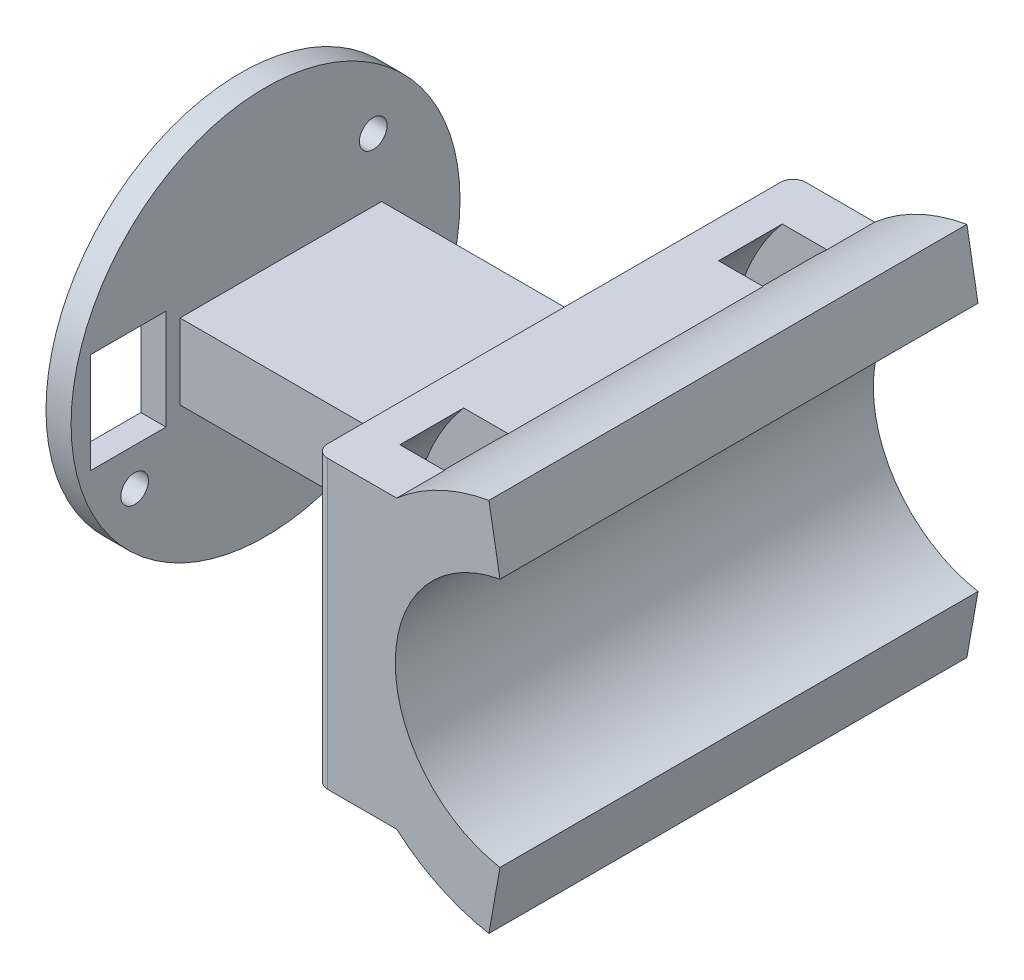
ISO-10303-21;
HEADER;
FILE_DESCRIPTION(('STEP AP214'),'2;1');
FILE_NAME('part.step','',(''),(''),'','','');
FILE_SCHEMA(('AUTOMOTIVE_DESIGN { 1 0 10303 214 1 1 1 1 }'));
ENDSEC;
DATA;
#1=APPLICATION_CONTEXT('core data for automotive mechanical design processes');
#2=APPLICATION_PROTOCOL_DEFINITION('international standard','automotive_design',2000,#1);
#3=PRODUCT_CONTEXT('',#1,'mechanical');
#4=PRODUCT('Part','Part','',(#3));
#5=PRODUCT_RELATED_PRODUCT_CATEGORY('part','',(#4));
#6=PRODUCT_DEFINITION_FORMATION('','',#4);
#7=PRODUCT_DEFINITION_CONTEXT('part definition',#1,'design');
#8=PRODUCT_DEFINITION('design','',#6,#7);
#9=PRODUCT_DEFINITION_SHAPE('','',#8);
#10=(LENGTH_UNIT() NAMED_UNIT(*) SI_UNIT(.MILLI.,.METRE.));
#11=(NAMED_UNIT(*) PLANE_ANGLE_UNIT() SI_UNIT($,.RADIAN.));
#12=(NAMED_UNIT(*) SI_UNIT($,.STERADIAN.) SOLID_ANGLE_UNIT());
#13=UNCERTAINTY_MEASURE_WITH_UNIT(LENGTH_MEASURE(1.E-05),#10,'distance_accuracy_value','');
#14=(GEOMETRIC_REPRESENTATION_CONTEXT(3) GLOBAL_UNCERTAINTY_ASSIGNED_CONTEXT((#13)) GLOBAL_UNIT_ASSIGNED_CONTEXT((#10,
#11,#12)) REPRESENTATION_CONTEXT('',''));
#15=CARTESIAN_POINT('',(0.,0.,0.));
#16=DIRECTION('',(0.,0.,1.));
#17=DIRECTION('',(1.,0.,0.));
#18=AXIS2_PLACEMENT_3D('',#15,#16,#17);
#19=CARTESIAN_POINT('',(-6.38936934946346,-11.43,19.05));
#20=DIRECTION('',(1.,0.,0.));
#21=DIRECTION('',(0.,1.,0.));
#22=AXIS2_PLACEMENT_3D('',#19,#20,#21);
#23=PLANE('',#22);
#24=DIRECTION('',(0.,0.,1.));
#25=VECTOR('',#24,1.);
#26=CARTESIAN_POINT('',(-6.38936934946345,-6.48838180573363,19.05));
#27=LINE('',#26,#25);
#28=CARTESIAN_POINT('',(-6.38936934946345,-6.48838180573363,-15.24));
#29=VERTEX_POINT('',#28);
#30=CARTESIAN_POINT('',(-6.38936934946346,-6.48838180573361,-10.16));
#31=VERTEX_POINT('',#30);
#32=EDGE_CURVE('E364',#29,#31,#27,.T.);
#33=ORIENTED_EDGE('',*,*,#32,.F.);
#34=DIRECTION('',(0.,1.,0.));
#35=VECTOR('',#34,1.);
#36=CARTESIAN_POINT('',(-6.38936934946346,-11.43,-15.24));
#37=LINE('',#36,#35);
#38=CARTESIAN_POINT('',(-6.38936934946345,6.48838180573364,-15.24));
#39=VERTEX_POINT('',#38);
#40=EDGE_CURVE('E349',#29,#39,#37,.T.);
#41=ORIENTED_EDGE('',*,*,#40,.T.);
#42=DIRECTION('',(0.,0.,1.));
#43=VECTOR('',#42,1.);
#44=CARTESIAN_POINT('',(-6.38936934946345,6.48838180573364,19.05));
#45=LINE('',#44,#43);
#46=CARTESIAN_POINT('',(-6.38936934946346,6.48838180573362,-10.16));
#47=VERTEX_POINT('',#46);
#48=EDGE_CURVE('E367',#47,#39,#45,.F.);
#49=ORIENTED_EDGE('',*,*,#48,.F.);
#50=DIRECTION('',(0.,1.,0.));
#51=VECTOR('',#50,1.);
#52=CARTESIAN_POINT('',(-6.38936934946346,-11.43,-10.16));
#53=LINE('',#52,#51);
#54=EDGE_CURVE('E341',#31,#47,#53,.T.);
#55=ORIENTED_EDGE('',*,*,#54,.F.);
#56=EDGE_LOOP('',(#33,#41,#49,#55));
#57=FACE_BOUND('',#56,.T.);
#58=DIRECTION('',(0.,-1.,0.));
#59=VECTOR('',#58,1.);
#60=CARTESIAN_POINT('',(-6.38936934946346,-3.,-9.2493893907033));
#61=LINE('',#60,#59);
#62=CARTESIAN_POINT('',(-6.38936934946346,3.,-9.2493893907033));
#63=VERTEX_POINT('',#62);
#64=CARTESIAN_POINT('',(-6.38936934946346,-3.,-9.2493893907033));
#65=VERTEX_POINT('',#64);
#66=EDGE_CURVE('E369',#63,#65,#61,.T.);
#67=ORIENTED_EDGE('',*,*,#66,.F.);
#68=DIRECTION('',(0.,0.,-1.));
#69=VECTOR('',#68,1.);
#70=CARTESIAN_POINT('',(-6.38936934946346,3.,-9.2493893907033));
#71=LINE('',#70,#69);
#72=CARTESIAN_POINT('',(-6.38936934946346,3.,6.82201027291285));
#73=VERTEX_POINT('',#72);
#74=EDGE_CURVE('E374',#73,#63,#71,.T.);
#75=ORIENTED_EDGE('',*,*,#74,.F.);
#76=DIRECTION('',(0.,1.,0.));
#77=VECTOR('',#76,1.);
#78=CARTESIAN_POINT('',(-6.38936934946346,-3.,6.82201027291285));
#79=LINE('',#78,#77);
#80=CARTESIAN_POINT('',(-6.38936934946346,-3.,6.82201027291285));
#81=VERTEX_POINT('',#80);
#82=EDGE_CURVE('E389',#81,#73,#79,.T.);
#83=ORIENTED_EDGE('',*,*,#82,.F.);
#84=DIRECTION('',(0.,0.,1.));
#85=VECTOR('',#84,1.);
#86=CARTESIAN_POINT('',(-6.38936934946346,-3.,-9.2493893907033));
#87=LINE('',#86,#85);
#88=EDGE_CURVE('E386',#65,#81,#87,.T.);
#89=ORIENTED_EDGE('',*,*,#88,.F.);
#90=EDGE_LOOP('',(#67,#75,#83,#89));
#91=FACE_BOUND('',#90,.T.);
#92=DIRECTION('',(0.,0.,-1.));
#93=VECTOR('',#92,1.);
#94=CARTESIAN_POINT('',(-6.38936934946346,11.43,19.05));
#95=LINE('',#94,#93);
#96=CARTESIAN_POINT('',(-6.38936934946346,11.43,18.05));
#97=VERTEX_POINT('',#96);
#98=CARTESIAN_POINT('',(-6.38936934946346,11.43,-18.05));
#99=VERTEX_POINT('',#98);
#100=EDGE_CURVE('E451',#97,#99,#95,.T.);
#101=ORIENTED_EDGE('',*,*,#100,.T.);
#102=DIRECTION('',(0.,-1.,0.));
#103=VECTOR('',#102,1.);
#104=CARTESIAN_POINT('',(-6.38936934946346,-11.43,-18.05));
#105=LINE('',#104,#103);
#106=CARTESIAN_POINT('',(-6.38936934946346,-11.43,-18.05));
#107=VERTEX_POINT('',#106);
#108=EDGE_CURVE('E471',#99,#107,#105,.T.);
#109=ORIENTED_EDGE('',*,*,#108,.T.);
#110=DIRECTION('',(0.,0.,-1.));
#111=VECTOR('',#110,1.);
#112=CARTESIAN_POINT('',(-6.38936934946346,-11.43,19.05));
#113=LINE('',#112,#111);
#114=CARTESIAN_POINT('',(-6.38936934946346,-11.43,18.05));
#115=VERTEX_POINT('',#114);
#116=EDGE_CURVE('E447',#115,#107,#113,.T.);
#117=ORIENTED_EDGE('',*,*,#116,.F.);
#118=DIRECTION('',(0.,-1.,0.));
#119=VECTOR('',#118,1.);
#120=CARTESIAN_POINT('',(-6.38936934946346,-11.43,18.05));
#121=LINE('',#120,#119);
#122=EDGE_CURVE('E469',#115,#97,#121,.F.);
#123=ORIENTED_EDGE('',*,*,#122,.T.);
#124=EDGE_LOOP('',(#101,#109,#117,#123));
#125=FACE_BOUND('',#124,.T.);
#126=DIRECTION('',(0.,1.,0.));
#127=VECTOR('',#126,1.);
#128=CARTESIAN_POINT('',(-6.38936934946346,-11.43,15.24));
#129=LINE('',#128,#127);
#130=CARTESIAN_POINT('',(-6.38936934946346,-6.48838180573362,15.24));
#131=VERTEX_POINT('',#130);
#132=CARTESIAN_POINT('',(-6.38936934946346,6.48838180573363,15.24));
#133=VERTEX_POINT('',#132);
#134=EDGE_CURVE('E335',#131,#133,#129,.T.);
#135=ORIENTED_EDGE('',*,*,#134,.F.);
#136=DIRECTION('',(0.,0.,1.));
#137=VECTOR('',#136,1.);
#138=CARTESIAN_POINT('',(-6.38936934946345,-6.48838180573364,19.05));
#139=LINE('',#138,#137);
#140=CARTESIAN_POINT('',(-6.38936934946346,-6.48838180573362,10.16));
#141=VERTEX_POINT('',#140);
#142=EDGE_CURVE('E355',#131,#141,#139,.F.);
#143=ORIENTED_EDGE('',*,*,#142,.T.);
#144=DIRECTION('',(0.,1.,0.));
#145=VECTOR('',#144,1.);
#146=CARTESIAN_POINT('',(-6.38936934946346,-11.43,10.16));
#147=LINE('',#146,#145);
#148=CARTESIAN_POINT('',(-6.38936934946346,6.48838180573363,10.16));
#149=VERTEX_POINT('',#148);
#150=EDGE_CURVE('E328',#141,#149,#147,.T.);
#151=ORIENTED_EDGE('',*,*,#150,.T.);
#152=DIRECTION('',(0.,0.,1.));
#153=VECTOR('',#152,1.);
#154=CARTESIAN_POINT('',(-6.38936934946345,6.48838180573365,19.05));
#155=LINE('',#154,#153);
#156=EDGE_CURVE('E358',#149,#133,#155,.T.);
#157=ORIENTED_EDGE('',*,*,#156,.T.);
#158=EDGE_LOOP('',(#135,#143,#151,#157));
#159=FACE_BOUND('',#158,.T.);
#160=ADVANCED_FACE('F45',(#57,#91,#125,#159),#23,.F.);
#161=CARTESIAN_POINT('',(0.110630650536534,11.43,19.05));
#162=DIRECTION('',(0.,-1.,0.));
#163=DIRECTION('',(1.,0.,0.));
#164=AXIS2_PLACEMENT_3D('',#161,#162,#163);
#165=PLANE('',#164);
#166=DIRECTION('',(-1.,0.,0.));
#167=VECTOR('',#166,1.);
#168=CARTESIAN_POINT('',(0.110630650536534,11.43,-19.05));
#169=LINE('',#168,#167);
#170=CARTESIAN_POINT('',(0.110630650536534,11.43,-19.05));
#171=VERTEX_POINT('',#170);
#172=CARTESIAN_POINT('',(-5.38936934946346,11.43,-19.05));
#173=VERTEX_POINT('',#172);
#174=EDGE_CURVE('E431',#171,#173,#169,.T.);
#175=ORIENTED_EDGE('',*,*,#174,.T.);
#176=CARTESIAN_POINT('',(-5.38936934946346,11.43,-18.05));
#177=DIRECTION('',(0.,-1.,0.));
#178=DIRECTION('',(1.,0.,0.));
#179=AXIS2_PLACEMENT_3D('',#176,#177,#178);
#180=CIRCLE('',#179,1.);
#181=EDGE_CURVE('E53',#173,#99,#180,.F.);
#182=ORIENTED_EDGE('',*,*,#181,.T.);
#183=ORIENTED_EDGE('',*,*,#100,.F.);
#184=CARTESIAN_POINT('',(-5.38936934946346,11.43,18.05));
#185=DIRECTION('',(0.,-1.,0.));
#186=DIRECTION('',(1.,0.,0.));
#187=AXIS2_PLACEMENT_3D('',#184,#185,#186);
#188=CIRCLE('',#187,1.);
#189=CARTESIAN_POINT('',(-5.38936934946346,11.43,19.05));
#190=VERTEX_POINT('',#189);
#191=EDGE_CURVE('E60',#97,#190,#188,.F.);
#192=ORIENTED_EDGE('',*,*,#191,.T.);
#193=DIRECTION('',(-1.,0.,0.));
#194=VECTOR('',#193,1.);
#195=CARTESIAN_POINT('',(0.110630650536534,11.43,19.05));
#196=LINE('',#195,#194);
#197=CARTESIAN_POINT('',(0.110630650536534,11.43,19.05));
#198=VERTEX_POINT('',#197);
#199=EDGE_CURVE('E414',#198,#190,#196,.T.);
#200=ORIENTED_EDGE('',*,*,#199,.F.);
#201=DIRECTION('',(0.,0.,-1.));
#202=VECTOR('',#201,1.);
#203=CARTESIAN_POINT('',(0.110630650536534,11.43,19.05));
#204=LINE('',#203,#202);
#205=CARTESIAN_POINT('',(0.110630650536528,11.43,15.24));
#206=VERTEX_POINT('',#205);
#207=EDGE_CURVE('E455',#198,#206,#204,.T.);
#208=ORIENTED_EDGE('',*,*,#207,.T.);
#209=DIRECTION('',(1.,0.,0.));
#210=VECTOR('',#209,1.);
#211=CARTESIAN_POINT('',(0.110630650536534,11.43,15.24));
#212=LINE('',#211,#210);
#213=CARTESIAN_POINT('',(-3.44080869076881,11.43,15.24));
#214=VERTEX_POINT('',#213);
#215=EDGE_CURVE('E333',#214,#206,#212,.T.);
#216=ORIENTED_EDGE('',*,*,#215,.F.);
#217=DIRECTION('',(0.,0.,1.));
#218=VECTOR('',#217,1.);
#219=CARTESIAN_POINT('',(-3.44080869076881,11.43,19.05));
#220=LINE('',#219,#218);
#221=CARTESIAN_POINT('',(-3.44080869076881,11.43,10.16));
#222=VERTEX_POINT('',#221);
#223=EDGE_CURVE('E352',#214,#222,#220,.F.);
#224=ORIENTED_EDGE('',*,*,#223,.T.);
#225=DIRECTION('',(1.,0.,0.));
#226=VECTOR('',#225,1.);
#227=CARTESIAN_POINT('',(0.110630650536534,11.43,10.16));
#228=LINE('',#227,#226);
#229=CARTESIAN_POINT('',(0.110630650536534,11.43,10.16));
#230=VERTEX_POINT('',#229);
#231=EDGE_CURVE('E325',#222,#230,#228,.T.);
#232=ORIENTED_EDGE('',*,*,#231,.T.);
#233=CARTESIAN_POINT('',(0.110630650536537,11.43,-10.16));
#234=VERTEX_POINT('',#233);
#235=EDGE_CURVE('E459',#230,#234,#204,.T.);
#236=ORIENTED_EDGE('',*,*,#235,.T.);
#237=DIRECTION('',(1.,0.,0.));
#238=VECTOR('',#237,1.);
#239=CARTESIAN_POINT('',(0.110630650536534,11.43,-10.16));
#240=LINE('',#239,#238);
#241=CARTESIAN_POINT('',(-3.44080869076881,11.43,-10.16));
#242=VERTEX_POINT('',#241);
#243=EDGE_CURVE('E339',#242,#234,#240,.T.);
#244=ORIENTED_EDGE('',*,*,#243,.F.);
#245=DIRECTION('',(0.,0.,1.));
#246=VECTOR('',#245,1.);
#247=CARTESIAN_POINT('',(-3.44080869076881,11.43,19.05));
#248=LINE('',#247,#246);
#249=CARTESIAN_POINT('',(-3.44080869076881,11.43,-15.24));
#250=VERTEX_POINT('',#249);
#251=EDGE_CURVE('E361',#250,#242,#248,.T.);
#252=ORIENTED_EDGE('',*,*,#251,.F.);
#253=DIRECTION('',(1.,0.,0.));
#254=VECTOR('',#253,1.);
#255=CARTESIAN_POINT('',(0.110630650536534,11.43,-15.24));
#256=LINE('',#255,#254);
#257=CARTESIAN_POINT('',(0.110630650536533,11.43,-15.24));
#258=VERTEX_POINT('',#257);
#259=EDGE_CURVE('E346',#250,#258,#256,.T.);
#260=ORIENTED_EDGE('',*,*,#259,.T.);
#261=EDGE_CURVE('E454',#258,#171,#204,.T.);
#262=ORIENTED_EDGE('',*,*,#261,.T.);
#263=EDGE_LOOP('',(#175,#182,#183,#192,#200,#208,#216,#224,#232,#236,#244,#252,#260,#262));
#264=FACE_BOUND('',#263,.T.);
#265=ADVANCED_FACE('F480',(#264),#165,.F.);
#266=CARTESIAN_POINT('',(0.110630650536537,-11.43,19.05));
#267=DIRECTION('',(0.,1.,0.));
#268=DIRECTION('',(-1.,0.,0.));
#269=AXIS2_PLACEMENT_3D('',#266,#267,#268);
#270=PLANE('',#269);
#271=ORIENTED_EDGE('',*,*,#116,.T.);
#272=CARTESIAN_POINT('',(-5.38936934946346,-11.43,-18.05));
#273=DIRECTION('',(0.,1.,0.));
#274=DIRECTION('',(-1.,0.,0.));
#275=AXIS2_PLACEMENT_3D('',#272,#273,#274);
#276=CIRCLE('',#275,1.);
#277=CARTESIAN_POINT('',(-5.38936934946346,-11.43,-19.05));
#278=VERTEX_POINT('',#277);
#279=EDGE_CURVE('E476',#107,#278,#276,.F.);
#280=ORIENTED_EDGE('',*,*,#279,.T.);
#281=DIRECTION('',(1.,0.,0.));
#282=VECTOR('',#281,1.);
#283=CARTESIAN_POINT('',(0.110630650536537,-11.43,-19.05));
#284=LINE('',#283,#282);
#285=CARTESIAN_POINT('',(0.11063065053654,-11.43,-19.05));
#286=VERTEX_POINT('',#285);
#287=EDGE_CURVE('E433',#278,#286,#284,.T.);
#288=ORIENTED_EDGE('',*,*,#287,.T.);
#289=DIRECTION('',(0.,0.,-1.));
#290=VECTOR('',#289,1.);
#291=CARTESIAN_POINT('',(0.11063065053654,-11.43,19.05));
#292=LINE('',#291,#290);
#293=CARTESIAN_POINT('',(0.110630650536542,-11.43,-15.24));
#294=VERTEX_POINT('',#293);
#295=EDGE_CURVE('E443',#294,#286,#292,.T.);
#296=ORIENTED_EDGE('',*,*,#295,.F.);
#297=DIRECTION('',(-1.,0.,0.));
#298=VECTOR('',#297,1.);
#299=CARTESIAN_POINT('',(0.110630650536537,-11.43,-15.24));
#300=LINE('',#299,#298);
#301=CARTESIAN_POINT('',(-3.4408086907688,-11.43,-15.24));
#302=VERTEX_POINT('',#301);
#303=EDGE_CURVE('E343',#294,#302,#300,.T.);
#304=ORIENTED_EDGE('',*,*,#303,.T.);
#305=DIRECTION('',(0.,0.,1.));
#306=VECTOR('',#305,1.);
#307=CARTESIAN_POINT('',(-3.4408086907688,-11.43,19.05));
#308=LINE('',#307,#306);
#309=CARTESIAN_POINT('',(-3.4408086907688,-11.43,-10.16));
#310=VERTEX_POINT('',#309);
#311=EDGE_CURVE('E467',#310,#302,#308,.F.);
#312=ORIENTED_EDGE('',*,*,#311,.F.);
#313=DIRECTION('',(-1.,0.,0.));
#314=VECTOR('',#313,1.);
#315=CARTESIAN_POINT('',(0.110630650536537,-11.43,-10.16));
#316=LINE('',#315,#314);
#317=CARTESIAN_POINT('',(0.11063065053654,-11.43,-10.16));
#318=VERTEX_POINT('',#317);
#319=EDGE_CURVE('E337',#318,#310,#316,.T.);
#320=ORIENTED_EDGE('',*,*,#319,.F.);
#321=CARTESIAN_POINT('',(0.11063065053654,-11.43,10.16));
#322=VERTEX_POINT('',#321);
#323=EDGE_CURVE('E448',#322,#318,#292,.T.);
#324=ORIENTED_EDGE('',*,*,#323,.F.);
#325=DIRECTION('',(-1.,0.,0.));
#326=VECTOR('',#325,1.);
#327=CARTESIAN_POINT('',(0.110630650536537,-11.43,10.16));
#328=LINE('',#327,#326);
#329=CARTESIAN_POINT('',(-3.44080869076881,-11.43,10.16));
#330=VERTEX_POINT('',#329);
#331=EDGE_CURVE('E312',#322,#330,#328,.T.);
#332=ORIENTED_EDGE('',*,*,#331,.T.);
#333=DIRECTION('',(0.,0.,1.));
#334=VECTOR('',#333,1.);
#335=CARTESIAN_POINT('',(-3.44080869076881,-11.43,19.05));
#336=LINE('',#335,#334);
#337=CARTESIAN_POINT('',(-3.44080869076881,-11.43,15.24));
#338=VERTEX_POINT('',#337);
#339=EDGE_CURVE('E464',#330,#338,#336,.T.);
#340=ORIENTED_EDGE('',*,*,#339,.T.);
#341=DIRECTION('',(-1.,0.,0.));
#342=VECTOR('',#341,1.);
#343=CARTESIAN_POINT('',(0.110630650536537,-11.43,15.24));
#344=LINE('',#343,#342);
#345=CARTESIAN_POINT('',(0.11063065053654,-11.43,15.24));
#346=VERTEX_POINT('',#345);
#347=EDGE_CURVE('E331',#346,#338,#344,.T.);
#348=ORIENTED_EDGE('',*,*,#347,.F.);
#349=CARTESIAN_POINT('',(0.11063065053654,-11.43,19.05));
#350=VERTEX_POINT('',#349);
#351=EDGE_CURVE('E444',#350,#346,#292,.T.);
#352=ORIENTED_EDGE('',*,*,#351,.F.);
#353=DIRECTION('',(1.,0.,0.));
#354=VECTOR('',#353,1.);
#355=CARTESIAN_POINT('',(0.110630650536537,-11.43,19.05));
#356=LINE('',#355,#354);
#357=CARTESIAN_POINT('',(-5.38936934946346,-11.43,19.05));
#358=VERTEX_POINT('',#357);
#359=EDGE_CURVE('E416',#358,#350,#356,.T.);
#360=ORIENTED_EDGE('',*,*,#359,.F.);
#361=CARTESIAN_POINT('',(-5.38936934946346,-11.43,18.05));
#362=DIRECTION('',(0.,1.,0.));
#363=DIRECTION('',(-1.,0.,0.));
#364=AXIS2_PLACEMENT_3D('',#361,#362,#363);
#365=CIRCLE('',#364,1.);
#366=EDGE_CURVE('E474',#358,#115,#365,.F.);
#367=ORIENTED_EDGE('',*,*,#366,.T.);
#368=EDGE_LOOP('',(#271,#280,#288,#296,#304,#312,#320,#324,#332,#340,#348,#352,#360,#367));
#369=FACE_BOUND('',#368,.T.);
#370=ADVANCED_FACE('F489',(#369),#270,.F.);
#371=CARTESIAN_POINT('',(10.1,0.,19.05));
#372=DIRECTION('',(0.,0.,-1.));
#373=DIRECTION('',(-1.,0.,0.));
#374=AXIS2_PLACEMENT_3D('',#371,#372,#373);
#375=CYLINDRICAL_SURFACE('',#374,10.1);
#376=CARTESIAN_POINT('',(10.1,0.,-19.05));
#377=DIRECTION('',(0.,0.,-1.));
#378=DIRECTION('',(-1.,0.,0.));
#379=AXIS2_PLACEMENT_3D('',#376,#377,#378);
#380=CIRCLE('',#379,10.1);
#381=CARTESIAN_POINT('',(8.34615340556399,-9.9465583054233,-19.05));
#382=VERTEX_POINT('',#381);
#383=CARTESIAN_POINT('',(8.34615340556399,9.9465583054233,-19.05));
#384=VERTEX_POINT('',#383);
#385=EDGE_CURVE('E405',#382,#384,#380,.T.);
#386=ORIENTED_EDGE('',*,*,#385,.T.);
#387=DIRECTION('',(0.,0.,-1.));
#388=VECTOR('',#387,1.);
#389=CARTESIAN_POINT('',(8.34615340556399,9.9465583054233,19.05));
#390=LINE('',#389,#388);
#391=CARTESIAN_POINT('',(8.34615340556399,9.9465583054233,19.05));
#392=VERTEX_POINT('',#391);
#393=EDGE_CURVE('E461',#392,#384,#390,.T.);
#394=ORIENTED_EDGE('',*,*,#393,.F.);
#395=CARTESIAN_POINT('',(10.1,0.,19.05));
#396=DIRECTION('',(0.,0.,-1.));
#397=DIRECTION('',(-1.,0.,0.));
#398=AXIS2_PLACEMENT_3D('',#395,#396,#397);
#399=CIRCLE('',#398,10.1);
#400=CARTESIAN_POINT('',(8.34615340556399,-9.9465583054233,19.05));
#401=VERTEX_POINT('',#400);
#402=EDGE_CURVE('E406',#401,#392,#399,.T.);
#403=ORIENTED_EDGE('',*,*,#402,.F.);
#404=DIRECTION('',(0.,0.,-1.));
#405=VECTOR('',#404,1.);
#406=CARTESIAN_POINT('',(8.34615340556399,-9.9465583054233,19.05));
#407=LINE('',#406,#405);
#408=EDGE_CURVE('E422',#401,#382,#407,.T.);
#409=ORIENTED_EDGE('',*,*,#408,.T.);
#410=EDGE_LOOP('',(#386,#394,#403,#409));
#411=FACE_BOUND('',#410,.T.);
#412=ADVANCED_FACE('F535',(#411),#375,.F.);
#413=CARTESIAN_POINT('',(8.34615340556399,9.9465583054233,19.05));
#414=DIRECTION('',(-0.984807753012208,-0.173648177666931,0.));
#415=DIRECTION('',(0.173648177666931,-0.984807753012208,0.));
#416=AXIS2_PLACEMENT_3D('',#413,#414,#415);
#417=PLANE('',#416);
#418=DIRECTION('',(-0.173648177666931,0.984807753012208,0.));
#419=VECTOR('',#418,1.);
#420=CARTESIAN_POINT('',(8.34615340556399,9.9465583054233,-19.05));
#421=LINE('',#420,#419);
#422=CARTESIAN_POINT('',(7.46402066301598,14.9493816907253,-19.05));
#423=VERTEX_POINT('',#422);
#424=EDGE_CURVE('E425',#384,#423,#421,.T.);
#425=ORIENTED_EDGE('',*,*,#424,.T.);
#426=DIRECTION('',(0.,0.,-1.));
#427=VECTOR('',#426,1.);
#428=CARTESIAN_POINT('',(7.46402066301598,14.9493816907253,19.05));
#429=LINE('',#428,#427);
#430=CARTESIAN_POINT('',(7.46402066301598,14.9493816907253,19.05));
#431=VERTEX_POINT('',#430);
#432=EDGE_CURVE('E458',#431,#423,#429,.T.);
#433=ORIENTED_EDGE('',*,*,#432,.F.);
#434=DIRECTION('',(-0.173648177666931,0.984807753012208,0.));
#435=VECTOR('',#434,1.);
#436=CARTESIAN_POINT('',(8.34615340556399,9.9465583054233,19.05));
#437=LINE('',#436,#435);
#438=EDGE_CURVE('E409',#392,#431,#437,.T.);
#439=ORIENTED_EDGE('',*,*,#438,.F.);
#440=ORIENTED_EDGE('',*,*,#393,.T.);
#441=EDGE_LOOP('',(#425,#433,#439,#440));
#442=FACE_BOUND('',#441,.T.);
#443=ADVANCED_FACE('F532',(#442),#417,.F.);
#444=CARTESIAN_POINT('',(10.1,0.,19.05));
#445=DIRECTION('',(0.,0.,-1.));
#446=DIRECTION('',(-1.,0.,0.));
#447=AXIS2_PLACEMENT_3D('',#444,#445,#446);
#448=CYLINDRICAL_SURFACE('',#447,15.18);
#449=ORIENTED_EDGE('',*,*,#432,.T.);
#450=CARTESIAN_POINT('',(10.1,0.,-19.05));
#451=DIRECTION('',(0.,0.,1.));
#452=DIRECTION('',(-1.,0.,0.));
#453=AXIS2_PLACEMENT_3D('',#450,#451,#452);
#454=CIRCLE('',#453,15.18);
#455=EDGE_CURVE('E428',#423,#171,#454,.T.);
#456=ORIENTED_EDGE('',*,*,#455,.T.);
#457=ORIENTED_EDGE('',*,*,#261,.F.);
#458=CARTESIAN_POINT('',(10.1,0.,-15.24));
#459=DIRECTION('',(0.,0.,1.));
#460=DIRECTION('',(1.,0.,0.));
#461=AXIS2_PLACEMENT_3D('',#458,#459,#460);
#462=CIRCLE('',#461,15.18);
#463=EDGE_CURVE('E309',#258,#294,#462,.T.);
#464=ORIENTED_EDGE('',*,*,#463,.T.);
#465=ORIENTED_EDGE('',*,*,#295,.T.);
#466=CARTESIAN_POINT('',(10.1,0.,-19.05));
#467=DIRECTION('',(0.,0.,1.));
#468=DIRECTION('',(-1.,0.,0.));
#469=AXIS2_PLACEMENT_3D('',#466,#467,#468);
#470=CIRCLE('',#469,15.18);
#471=CARTESIAN_POINT('',(7.46402066301598,-14.9493816907253,-19.05));
#472=VERTEX_POINT('',#471);
#473=EDGE_CURVE('E435',#286,#472,#470,.T.);
#474=ORIENTED_EDGE('',*,*,#473,.T.);
#475=DIRECTION('',(0.,0.,-1.));
#476=VECTOR('',#475,1.);
#477=CARTESIAN_POINT('',(7.46402066301598,-14.9493816907253,19.05));
#478=LINE('',#477,#476);
#479=CARTESIAN_POINT('',(7.46402066301598,-14.9493816907253,19.05));
#480=VERTEX_POINT('',#479);
#481=EDGE_CURVE('E441',#480,#472,#478,.T.);
#482=ORIENTED_EDGE('',*,*,#481,.F.);
#483=CARTESIAN_POINT('',(10.1,0.,19.05));
#484=DIRECTION('',(0.,0.,1.));
#485=DIRECTION('',(-1.,0.,0.));
#486=AXIS2_PLACEMENT_3D('',#483,#484,#485);
#487=CIRCLE('',#486,15.18);
#488=EDGE_CURVE('E418',#350,#480,#487,.T.);
#489=ORIENTED_EDGE('',*,*,#488,.F.);
#490=ORIENTED_EDGE('',*,*,#351,.T.);
#491=CARTESIAN_POINT('',(10.1,0.,15.24));
#492=DIRECTION('',(0.,0.,1.));
#493=DIRECTION('',(1.,0.,0.));
#494=AXIS2_PLACEMENT_3D('',#491,#492,#493);
#495=CIRCLE('',#494,15.18);
#496=EDGE_CURVE('E318',#206,#346,#495,.T.);
#497=ORIENTED_EDGE('',*,*,#496,.F.);
#498=ORIENTED_EDGE('',*,*,#207,.F.);
#499=CARTESIAN_POINT('',(10.1,0.,19.05));
#500=DIRECTION('',(0.,0.,1.));
#501=DIRECTION('',(-1.,0.,0.));
#502=AXIS2_PLACEMENT_3D('',#499,#500,#501);
#503=CIRCLE('',#502,15.18);
#504=EDGE_CURVE('E412',#431,#198,#503,.T.);
#505=ORIENTED_EDGE('',*,*,#504,.F.);
#506=EDGE_LOOP('',(#449,#456,#457,#464,#465,#474,#482,#489,#490,#497,#498,#505));
#507=FACE_BOUND('',#506,.T.);
#508=CARTESIAN_POINT('',(10.1,0.,-10.16));
#509=DIRECTION('',(0.,0.,1.));
#510=DIRECTION('',(1.,0.,0.));
#511=AXIS2_PLACEMENT_3D('',#508,#509,#510);
#512=CIRCLE('',#511,15.18);
#513=EDGE_CURVE('E298',#234,#318,#512,.T.);
#514=ORIENTED_EDGE('',*,*,#513,.F.);
#515=ORIENTED_EDGE('',*,*,#235,.F.);
#516=CARTESIAN_POINT('',(10.1,0.,10.16));
#517=DIRECTION('',(0.,0.,1.));
#518=DIRECTION('',(1.,0.,0.));
#519=AXIS2_PLACEMENT_3D('',#516,#517,#518);
#520=CIRCLE('',#519,15.18);
#521=EDGE_CURVE('E315',#230,#322,#520,.T.);
#522=ORIENTED_EDGE('',*,*,#521,.T.);
#523=ORIENTED_EDGE('',*,*,#323,.T.);
#524=EDGE_LOOP('',(#514,#515,#522,#523));
#525=FACE_BOUND('',#524,.T.);
#526=ADVANCED_FACE('F498',(#507,#525),#448,.T.);
#527=CARTESIAN_POINT('',(8.34615340556399,-9.9465583054233,19.05));
#528=DIRECTION('',(-0.984807753012208,0.173648177666931,0.));
#529=DIRECTION('',(-0.173648177666931,-0.984807753012208,0.));
#530=AXIS2_PLACEMENT_3D('',#527,#528,#529);
#531=PLANE('',#530);
#532=DIRECTION('',(0.173648177666931,0.984807753012208,0.));
#533=VECTOR('',#532,1.);
#534=CARTESIAN_POINT('',(8.34615340556399,-9.9465583054233,-19.05));
#535=LINE('',#534,#533);
#536=EDGE_CURVE('E410',#472,#382,#535,.T.);
#537=ORIENTED_EDGE('',*,*,#536,.T.);
#538=ORIENTED_EDGE('',*,*,#408,.F.);
#539=DIRECTION('',(0.173648177666931,0.984807753012208,0.));
#540=VECTOR('',#539,1.);
#541=CARTESIAN_POINT('',(8.34615340556399,-9.9465583054233,19.05));
#542=LINE('',#541,#540);
#543=EDGE_CURVE('E420',#480,#401,#542,.T.);
#544=ORIENTED_EDGE('',*,*,#543,.F.);
#545=ORIENTED_EDGE('',*,*,#481,.T.);
#546=EDGE_LOOP('',(#537,#538,#544,#545));
#547=FACE_BOUND('',#546,.T.);
#548=ADVANCED_FACE('F538',(#547),#531,.F.);
#549=CARTESIAN_POINT('',(10.1,0.,19.05));
#550=DIRECTION('',(0.,0.,-1.));
#551=DIRECTION('',(-1.,0.,0.));
#552=AXIS2_PLACEMENT_3D('',#549,#550,#551);
#553=PLANE('',#552);
#554=ORIENTED_EDGE('',*,*,#199,.T.);
#555=DIRECTION('',(0.,-1.,0.));
#556=VECTOR('',#555,1.);
#557=CARTESIAN_POINT('',(-5.38936934946346,0.,19.05));
#558=LINE('',#557,#556);
#559=EDGE_CURVE('E11',#190,#358,#558,.T.);
#560=ORIENTED_EDGE('',*,*,#559,.T.);
#561=ORIENTED_EDGE('',*,*,#359,.T.);
#562=ORIENTED_EDGE('',*,*,#488,.T.);
#563=ORIENTED_EDGE('',*,*,#543,.T.);
#564=ORIENTED_EDGE('',*,*,#402,.T.);
#565=ORIENTED_EDGE('',*,*,#438,.T.);
#566=ORIENTED_EDGE('',*,*,#504,.T.);
#567=EDGE_LOOP('',(#554,#560,#561,#562,#563,#564,#565,#566));
#568=FACE_BOUND('',#567,.T.);
#569=ADVANCED_FACE('F540',(#568),#553,.F.);
#570=CARTESIAN_POINT('',(10.1,0.,-19.05));
#571=DIRECTION('',(0.,0.,-1.));
#572=DIRECTION('',(-1.,0.,0.));
#573=AXIS2_PLACEMENT_3D('',#570,#571,#572);
#574=PLANE('',#573);
#575=ORIENTED_EDGE('',*,*,#287,.F.);
#576=DIRECTION('',(0.,-1.,0.));
#577=VECTOR('',#576,1.);
#578=CARTESIAN_POINT('',(-5.38936934946346,11.43,-19.05));
#579=LINE('',#578,#577);
#580=EDGE_CURVE('E68',#278,#173,#579,.F.);
#581=ORIENTED_EDGE('',*,*,#580,.T.);
#582=ORIENTED_EDGE('',*,*,#174,.F.);
#583=ORIENTED_EDGE('',*,*,#455,.F.);
#584=ORIENTED_EDGE('',*,*,#424,.F.);
#585=ORIENTED_EDGE('',*,*,#385,.F.);
#586=ORIENTED_EDGE('',*,*,#536,.F.);
#587=ORIENTED_EDGE('',*,*,#473,.F.);
#588=EDGE_LOOP('',(#575,#581,#582,#583,#584,#585,#586,#587));
#589=FACE_BOUND('',#588,.T.);
#590=ADVANCED_FACE('F493',(#589),#574,.T.);
#591=CARTESIAN_POINT('',(-29.3893693494635,-3.,-9.2493893907033));
#592=DIRECTION('',(0.,0.,1.));
#593=DIRECTION('',(1.,0.,0.));
#594=AXIS2_PLACEMENT_3D('',#591,#592,#593);
#595=PLANE('',#594);
#596=ORIENTED_EDGE('',*,*,#66,.T.);
#597=DIRECTION('',(1.,0.,0.));
#598=VECTOR('',#597,1.);
#599=CARTESIAN_POINT('',(-29.3893693494635,-3.,-9.2493893907033));
#600=LINE('',#599,#598);
#601=CARTESIAN_POINT('',(-29.3893693494635,-3.,-9.2493893907033));
#602=VERTEX_POINT('',#601);
#603=EDGE_CURVE('E402',#602,#65,#600,.T.);
#604=ORIENTED_EDGE('',*,*,#603,.F.);
#605=DIRECTION('',(0.,-1.,0.));
#606=VECTOR('',#605,1.);
#607=CARTESIAN_POINT('',(-29.3893693494635,-3.,-9.2493893907033));
#608=LINE('',#607,#606);
#609=CARTESIAN_POINT('',(-29.3893693494635,3.,-9.2493893907033));
#610=VERTEX_POINT('',#609);
#611=EDGE_CURVE('E370',#610,#602,#608,.T.);
#612=ORIENTED_EDGE('',*,*,#611,.F.);
#613=DIRECTION('',(1.,0.,0.));
#614=VECTOR('',#613,1.);
#615=CARTESIAN_POINT('',(-29.3893693494635,3.,-9.2493893907033));
#616=LINE('',#615,#614);
#617=EDGE_CURVE('E383',#610,#63,#616,.T.);
#618=ORIENTED_EDGE('',*,*,#617,.T.);
#619=EDGE_LOOP('',(#596,#604,#612,#618));
#620=FACE_BOUND('',#619,.T.);
#621=ADVANCED_FACE('F602',(#620),#595,.F.);
#622=CARTESIAN_POINT('',(-29.3893693494635,-3.,-9.2493893907033));
#623=DIRECTION('',(0.,1.,0.));
#624=DIRECTION('',(0.,0.,1.));
#625=AXIS2_PLACEMENT_3D('',#622,#623,#624);
#626=PLANE('',#625);
#627=ORIENTED_EDGE('',*,*,#88,.T.);
#628=DIRECTION('',(1.,0.,0.));
#629=VECTOR('',#628,1.);
#630=CARTESIAN_POINT('',(-29.3893693494635,-3.,6.82201027291285));
#631=LINE('',#630,#629);
#632=CARTESIAN_POINT('',(-29.3893693494635,-3.,6.82201027291285));
#633=VERTEX_POINT('',#632);
#634=EDGE_CURVE('E399',#633,#81,#631,.T.);
#635=ORIENTED_EDGE('',*,*,#634,.F.);
#636=DIRECTION('',(0.,0.,1.));
#637=VECTOR('',#636,1.);
#638=CARTESIAN_POINT('',(-29.3893693494635,-3.,-9.2493893907033));
#639=LINE('',#638,#637);
#640=EDGE_CURVE('E373',#602,#633,#639,.T.);
#641=ORIENTED_EDGE('',*,*,#640,.F.);
#642=ORIENTED_EDGE('',*,*,#603,.T.);
#643=EDGE_LOOP('',(#627,#635,#641,#642));
#644=FACE_BOUND('',#643,.T.);
#645=ADVANCED_FACE('F720',(#644),#626,.F.);
#646=CARTESIAN_POINT('',(-29.3893693494635,-3.,6.82201027291285));
#647=DIRECTION('',(0.,0.,-1.));
#648=DIRECTION('',(-1.,0.,0.));
#649=AXIS2_PLACEMENT_3D('',#646,#647,#648);
#650=PLANE('',#649);
#651=ORIENTED_EDGE('',*,*,#82,.T.);
#652=DIRECTION('',(1.,0.,0.));
#653=VECTOR('',#652,1.);
#654=CARTESIAN_POINT('',(-29.3893693494635,3.,6.82201027291285));
#655=LINE('',#654,#653);
#656=CARTESIAN_POINT('',(-29.3893693494635,3.,6.82201027291285));
#657=VERTEX_POINT('',#656);
#658=EDGE_CURVE('E396',#657,#73,#655,.T.);
#659=ORIENTED_EDGE('',*,*,#658,.F.);
#660=DIRECTION('',(0.,1.,0.));
#661=VECTOR('',#660,1.);
#662=CARTESIAN_POINT('',(-29.3893693494635,-3.,6.82201027291285));
#663=LINE('',#662,#661);
#664=EDGE_CURVE('E377',#633,#657,#663,.T.);
#665=ORIENTED_EDGE('',*,*,#664,.F.);
#666=ORIENTED_EDGE('',*,*,#634,.T.);
#667=EDGE_LOOP('',(#651,#659,#665,#666));
#668=FACE_BOUND('',#667,.T.);
#669=ADVANCED_FACE('F729',(#668),#650,.F.);
#670=CARTESIAN_POINT('',(-29.3893693494635,3.,-9.2493893907033));
#671=DIRECTION('',(0.,-1.,0.));
#672=DIRECTION('',(0.,0.,-1.));
#673=AXIS2_PLACEMENT_3D('',#670,#671,#672);
#674=PLANE('',#673);
#675=ORIENTED_EDGE('',*,*,#74,.T.);
#676=ORIENTED_EDGE('',*,*,#617,.F.);
#677=DIRECTION('',(0.,0.,-1.));
#678=VECTOR('',#677,1.);
#679=CARTESIAN_POINT('',(-29.3893693494635,3.,-9.2493893907033));
#680=LINE('',#679,#678);
#681=EDGE_CURVE('E380',#657,#610,#680,.T.);
#682=ORIENTED_EDGE('',*,*,#681,.F.);
#683=ORIENTED_EDGE('',*,*,#658,.T.);
#684=EDGE_LOOP('',(#675,#676,#682,#683));
#685=FACE_BOUND('',#684,.T.);
#686=ADVANCED_FACE('F737',(#685),#674,.F.);
#687=CARTESIAN_POINT('',(10.1,0.,19.05));
#688=DIRECTION('',(0.,0.,1.));
#689=DIRECTION('',(1.,0.,0.));
#690=AXIS2_PLACEMENT_3D('',#687,#688,#689);
#691=CYLINDRICAL_SURFACE('',#690,17.72);
#692=CARTESIAN_POINT('',(10.1,0.,10.16));
#693=DIRECTION('',(0.,0.,1.));
#694=DIRECTION('',(1.,0.,0.));
#695=AXIS2_PLACEMENT_3D('',#692,#693,#694);
#696=CIRCLE('',#695,17.72);
#697=EDGE_CURVE('E313',#222,#149,#696,.T.);
#698=ORIENTED_EDGE('',*,*,#697,.F.);
#699=ORIENTED_EDGE('',*,*,#223,.F.);
#700=CARTESIAN_POINT('',(10.1,0.,15.24));
#701=DIRECTION('',(0.,0.,1.));
#702=DIRECTION('',(1.,0.,0.));
#703=AXIS2_PLACEMENT_3D('',#700,#701,#702);
#704=CIRCLE('',#703,17.72);
#705=EDGE_CURVE('E301',#214,#133,#704,.T.);
#706=ORIENTED_EDGE('',*,*,#705,.T.);
#707=ORIENTED_EDGE('',*,*,#156,.F.);
#708=EDGE_LOOP('',(#698,#699,#706,#707));
#709=FACE_BOUND('',#708,.T.);
#710=ADVANCED_FACE('F560',(#709),#691,.F.);
#711=EDGE_CURVE('E320',#131,#338,#704,.T.);
#712=ORIENTED_EDGE('',*,*,#711,.T.);
#713=ORIENTED_EDGE('',*,*,#339,.F.);
#714=EDGE_CURVE('E295',#141,#330,#696,.T.);
#715=ORIENTED_EDGE('',*,*,#714,.F.);
#716=ORIENTED_EDGE('',*,*,#142,.F.);
#717=EDGE_LOOP('',(#712,#713,#715,#716));
#718=FACE_BOUND('',#717,.T.);
#719=ADVANCED_FACE('F553',(#718),#691,.F.);
#720=CARTESIAN_POINT('',(0.,0.,15.24));
#721=DIRECTION('',(0.,0.,-1.));
#722=DIRECTION('',(-1.,0.,0.));
#723=AXIS2_PLACEMENT_3D('',#720,#721,#722);
#724=PLANE('',#723);
#725=ORIENTED_EDGE('',*,*,#134,.T.);
#726=ORIENTED_EDGE('',*,*,#705,.F.);
#727=ORIENTED_EDGE('',*,*,#215,.T.);
#728=ORIENTED_EDGE('',*,*,#496,.T.);
#729=ORIENTED_EDGE('',*,*,#347,.T.);
#730=ORIENTED_EDGE('',*,*,#711,.F.);
#731=EDGE_LOOP('',(#725,#726,#727,#728,#729,#730));
#732=FACE_BOUND('',#731,.T.);
#733=ADVANCED_FACE('F550',(#732),#724,.T.);
#734=CARTESIAN_POINT('',(0.,0.,10.16));
#735=DIRECTION('',(0.,0.,-1.));
#736=DIRECTION('',(-1.,0.,0.));
#737=AXIS2_PLACEMENT_3D('',#734,#735,#736);
#738=PLANE('',#737);
#739=ORIENTED_EDGE('',*,*,#714,.T.);
#740=ORIENTED_EDGE('',*,*,#331,.F.);
#741=ORIENTED_EDGE('',*,*,#521,.F.);
#742=ORIENTED_EDGE('',*,*,#231,.F.);
#743=ORIENTED_EDGE('',*,*,#697,.T.);
#744=ORIENTED_EDGE('',*,*,#150,.F.);
#745=EDGE_LOOP('',(#739,#740,#741,#742,#743,#744));
#746=FACE_BOUND('',#745,.T.);
#747=ADVANCED_FACE('F798',(#746),#738,.F.);
#748=CARTESIAN_POINT('',(10.1,0.,19.05));
#749=DIRECTION('',(0.,0.,1.));
#750=DIRECTION('',(1.,0.,0.));
#751=AXIS2_PLACEMENT_3D('',#748,#749,#750);
#752=CYLINDRICAL_SURFACE('',#751,17.72);
#753=ORIENTED_EDGE('',*,*,#48,.T.);
#754=CARTESIAN_POINT('',(10.1,0.,-15.24));
#755=DIRECTION('',(0.,0.,1.));
#756=DIRECTION('',(1.,0.,0.));
#757=AXIS2_PLACEMENT_3D('',#754,#755,#756);
#758=CIRCLE('',#757,17.72);
#759=EDGE_CURVE('E306',#250,#39,#758,.T.);
#760=ORIENTED_EDGE('',*,*,#759,.F.);
#761=ORIENTED_EDGE('',*,*,#251,.T.);
#762=CARTESIAN_POINT('',(10.1,0.,-10.16));
#763=DIRECTION('',(0.,0.,1.));
#764=DIRECTION('',(1.,0.,0.));
#765=AXIS2_PLACEMENT_3D('',#762,#763,#764);
#766=CIRCLE('',#765,17.72);
#767=EDGE_CURVE('E302',#242,#47,#766,.T.);
#768=ORIENTED_EDGE('',*,*,#767,.T.);
#769=EDGE_LOOP('',(#753,#760,#761,#768));
#770=FACE_BOUND('',#769,.T.);
#771=ADVANCED_FACE('F523',(#770),#752,.F.);
#772=ORIENTED_EDGE('',*,*,#32,.T.);
#773=EDGE_CURVE('E300',#31,#310,#766,.T.);
#774=ORIENTED_EDGE('',*,*,#773,.T.);
#775=ORIENTED_EDGE('',*,*,#311,.T.);
#776=EDGE_CURVE('E305',#29,#302,#758,.T.);
#777=ORIENTED_EDGE('',*,*,#776,.F.);
#778=EDGE_LOOP('',(#772,#774,#775,#777));
#779=FACE_BOUND('',#778,.T.);
#780=ADVANCED_FACE('F514',(#779),#752,.F.);
#781=CARTESIAN_POINT('',(0.,0.,-15.24));
#782=DIRECTION('',(0.,0.,-1.));
#783=DIRECTION('',(-1.,0.,0.));
#784=AXIS2_PLACEMENT_3D('',#781,#782,#783);
#785=PLANE('',#784);
#786=ORIENTED_EDGE('',*,*,#776,.T.);
#787=ORIENTED_EDGE('',*,*,#303,.F.);
#788=ORIENTED_EDGE('',*,*,#463,.F.);
#789=ORIENTED_EDGE('',*,*,#259,.F.);
#790=ORIENTED_EDGE('',*,*,#759,.T.);
#791=ORIENTED_EDGE('',*,*,#40,.F.);
#792=EDGE_LOOP('',(#786,#787,#788,#789,#790,#791));
#793=FACE_BOUND('',#792,.T.);
#794=ADVANCED_FACE('F708',(#793),#785,.F.);
#795=CARTESIAN_POINT('',(0.,0.,-10.16));
#796=DIRECTION('',(0.,0.,-1.));
#797=DIRECTION('',(-1.,0.,0.));
#798=AXIS2_PLACEMENT_3D('',#795,#796,#797);
#799=PLANE('',#798);
#800=ORIENTED_EDGE('',*,*,#54,.T.);
#801=ORIENTED_EDGE('',*,*,#767,.F.);
#802=ORIENTED_EDGE('',*,*,#243,.T.);
#803=ORIENTED_EDGE('',*,*,#513,.T.);
#804=ORIENTED_EDGE('',*,*,#319,.T.);
#805=ORIENTED_EDGE('',*,*,#773,.F.);
#806=EDGE_LOOP('',(#800,#801,#802,#803,#804,#805));
#807=FACE_BOUND('',#806,.T.);
#808=ADVANCED_FACE('F512',(#807),#799,.T.);
#809=CARTESIAN_POINT('',(-29.3893693494635,0.,0.));
#810=DIRECTION('',(-1.,0.,0.));
#811=DIRECTION('',(0.,0.,1.));
#812=AXIS2_PLACEMENT_3D('',#809,#810,#811);
#813=PLANE('',#812);
#814=CARTESIAN_POINT('',(-29.3893693494635,0.,0.));
#815=DIRECTION('',(-1.,0.,0.));
#816=DIRECTION('',(0.,0.,1.));
#817=AXIS2_PLACEMENT_3D('',#814,#815,#816);
#818=CIRCLE('',#817,15.5);
#819=CARTESIAN_POINT('',(-29.3893693494635,0.,15.5));
#820=VERTEX_POINT('',#819);
#821=EDGE_CURVE('E265',#820,#820,#818,.T.);
#822=ORIENTED_EDGE('',*,*,#821,.F.);
#823=EDGE_LOOP('',(#822));
#824=FACE_BOUND('',#823,.T.);
#825=DIRECTION('',(0.,0.,-1.));
#826=VECTOR('',#825,1.);
#827=CARTESIAN_POINT('',(-29.3893693494635,4.02571564197786,13.9361823695232));
#828=LINE('',#827,#826);
#829=CARTESIAN_POINT('',(-29.3893693494635,4.02571564197786,13.9361823695232));
#830=VERTEX_POINT('',#829);
#831=CARTESIAN_POINT('',(-29.3893693494635,4.02571564197786,7.93618236952319));
#832=VERTEX_POINT('',#831);
#833=EDGE_CURVE('E279',#830,#832,#828,.T.);
#834=ORIENTED_EDGE('',*,*,#833,.T.);
#835=DIRECTION('',(0.,-1.,0.));
#836=VECTOR('',#835,1.);
#837=CARTESIAN_POINT('',(-29.3893693494635,4.02571564197786,7.93618236952319));
#838=LINE('',#837,#836);
#839=CARTESIAN_POINT('',(-29.3893693494635,-3.97428435802213,7.93618236952319));
#840=VERTEX_POINT('',#839);
#841=EDGE_CURVE('E264',#832,#840,#838,.T.);
#842=ORIENTED_EDGE('',*,*,#841,.T.);
#843=DIRECTION('',(0.,0.,1.));
#844=VECTOR('',#843,1.);
#845=CARTESIAN_POINT('',(-29.3893693494635,-3.97428435802213,13.9361823695232));
#846=LINE('',#845,#844);
#847=CARTESIAN_POINT('',(-29.3893693494635,-3.97428435802213,13.9361823695232));
#848=VERTEX_POINT('',#847);
#849=EDGE_CURVE('E283',#840,#848,#846,.T.);
#850=ORIENTED_EDGE('',*,*,#849,.T.);
#851=DIRECTION('',(0.,1.,0.));
#852=VECTOR('',#851,1.);
#853=CARTESIAN_POINT('',(-29.3893693494635,4.02571564197786,13.9361823695232));
#854=LINE('',#853,#852);
#855=EDGE_CURVE('E258',#848,#830,#854,.T.);
#856=ORIENTED_EDGE('',*,*,#855,.T.);
#857=EDGE_LOOP('',(#834,#842,#850,#856));
#858=FACE_BOUND('',#857,.T.);
#859=CARTESIAN_POINT('',(-29.3893693494635,-6.97426488049745,10.4359727372306));
#860=DIRECTION('',(-1.,0.,0.));
#861=DIRECTION('',(0.,0.,1.));
#862=AXIS2_PLACEMENT_3D('',#859,#860,#861);
#863=CIRCLE('',#862,1.09996238605737);
#864=CARTESIAN_POINT('',(-29.3893693494635,-6.97426488049745,11.535935123288));
#865=VERTEX_POINT('',#864);
#866=EDGE_CURVE('E866',#865,#865,#863,.T.);
#867=ORIENTED_EDGE('',*,*,#866,.T.);
#868=EDGE_LOOP('',(#867));
#869=FACE_BOUND('',#868,.T.);
#870=CARTESIAN_POINT('',(-29.3893693494635,8.02573511950256,-8.58094871473817));
#871=DIRECTION('',(-1.,0.,0.));
#872=DIRECTION('',(0.,0.,1.));
#873=AXIS2_PLACEMENT_3D('',#870,#871,#872);
#874=CIRCLE('',#873,1.0993224);
#875=CARTESIAN_POINT('',(-29.3893693494635,8.02573511950256,-7.48162631473817));
#876=VERTEX_POINT('',#875);
#877=EDGE_CURVE('E869',#876,#876,#874,.T.);
#878=ORIENTED_EDGE('',*,*,#877,.T.);
#879=EDGE_LOOP('',(#878));
#880=FACE_BOUND('',#879,.T.);
#881=ORIENTED_EDGE('',*,*,#681,.T.);
#882=ORIENTED_EDGE('',*,*,#611,.T.);
#883=ORIENTED_EDGE('',*,*,#640,.T.);
#884=ORIENTED_EDGE('',*,*,#664,.T.);
#885=EDGE_LOOP('',(#881,#882,#883,#884));
#886=FACE_BOUND('',#885,.T.);
#887=ADVANCED_FACE('F688',(#824,#858,#869,#880,#886),#813,.F.);
#888=CARTESIAN_POINT('',(-31.3893693494635,0.,0.));
#889=DIRECTION('',(-1.,0.,0.));
#890=DIRECTION('',(0.,0.,1.));
#891=AXIS2_PLACEMENT_3D('',#888,#889,#890);
#892=PLANE('',#891);
#893=CARTESIAN_POINT('',(-31.3893693494635,-6.97426488049745,10.4359727372306));
#894=DIRECTION('',(-1.,0.,0.));
#895=DIRECTION('',(0.,0.,1.));
#896=AXIS2_PLACEMENT_3D('',#893,#894,#895);
#897=CIRCLE('',#896,1.09996238605737);
#898=CARTESIAN_POINT('',(-31.3893693494635,-6.97426488049745,11.535935123288));
#899=VERTEX_POINT('',#898);
#900=EDGE_CURVE('E281',#899,#899,#897,.T.);
#901=ORIENTED_EDGE('',*,*,#900,.F.);
#902=EDGE_LOOP('',(#901));
#903=FACE_BOUND('',#902,.T.);
#904=CARTESIAN_POINT('',(-31.3893693494635,0.,0.));
#905=DIRECTION('',(-1.,0.,0.));
#906=DIRECTION('',(0.,0.,1.));
#907=AXIS2_PLACEMENT_3D('',#904,#905,#906);
#908=CIRCLE('',#907,15.5);
#909=CARTESIAN_POINT('',(-31.3893693494635,0.,15.5));
#910=VERTEX_POINT('',#909);
#911=EDGE_CURVE('E292',#910,#910,#908,.T.);
#912=ORIENTED_EDGE('',*,*,#911,.T.);
#913=EDGE_LOOP('',(#912));
#914=FACE_BOUND('',#913,.T.);
#915=DIRECTION('',(0.,-1.,0.));
#916=VECTOR('',#915,1.);
#917=CARTESIAN_POINT('',(-31.3893693494635,4.02571564197786,7.93618236952319));
#918=LINE('',#917,#916);
#919=CARTESIAN_POINT('',(-31.3893693494635,4.02571564197786,7.93618236952319));
#920=VERTEX_POINT('',#919);
#921=CARTESIAN_POINT('',(-31.3893693494635,-3.97428435802213,7.93618236952319));
#922=VERTEX_POINT('',#921);
#923=EDGE_CURVE('E257',#920,#922,#918,.T.);
#924=ORIENTED_EDGE('',*,*,#923,.F.);
#925=DIRECTION('',(0.,0.,-1.));
#926=VECTOR('',#925,1.);
#927=CARTESIAN_POINT('',(-31.3893693494635,4.02571564197786,13.9361823695232));
#928=LINE('',#927,#926);
#929=CARTESIAN_POINT('',(-31.3893693494635,4.02571564197786,13.9361823695232));
#930=VERTEX_POINT('',#929);
#931=EDGE_CURVE('E247',#930,#920,#928,.T.);
#932=ORIENTED_EDGE('',*,*,#931,.F.);
#933=DIRECTION('',(0.,1.,0.));
#934=VECTOR('',#933,1.);
#935=CARTESIAN_POINT('',(-31.3893693494635,4.02571564197786,13.9361823695232));
#936=LINE('',#935,#934);
#937=CARTESIAN_POINT('',(-31.3893693494635,-3.97428435802213,13.9361823695232));
#938=VERTEX_POINT('',#937);
#939=EDGE_CURVE('E274',#938,#930,#936,.T.);
#940=ORIENTED_EDGE('',*,*,#939,.F.);
#941=DIRECTION('',(0.,0.,1.));
#942=VECTOR('',#941,1.);
#943=CARTESIAN_POINT('',(-31.3893693494635,-3.97428435802213,13.9361823695232));
#944=LINE('',#943,#942);
#945=EDGE_CURVE('E272',#922,#938,#944,.T.);
#946=ORIENTED_EDGE('',*,*,#945,.F.);
#947=EDGE_LOOP('',(#924,#932,#940,#946));
#948=FACE_BOUND('',#947,.T.);
#949=CARTESIAN_POINT('',(-31.3893693494635,8.02573511950256,-8.58094871473817));
#950=DIRECTION('',(-1.,0.,0.));
#951=DIRECTION('',(0.,0.,1.));
#952=AXIS2_PLACEMENT_3D('',#949,#950,#951);
#953=CIRCLE('',#952,1.0993224);
#954=CARTESIAN_POINT('',(-31.3893693494635,8.02573511950256,-7.48162631473817));
#955=VERTEX_POINT('',#954);
#956=EDGE_CURVE('E871',#955,#955,#953,.T.);
#957=ORIENTED_EDGE('',*,*,#956,.F.);
#958=EDGE_LOOP('',(#957));
#959=FACE_BOUND('',#958,.T.);
#960=ADVANCED_FACE('F269',(#903,#914,#948,#959),#892,.T.);
#961=CARTESIAN_POINT('',(-31.3893693494635,0.,0.));
#962=DIRECTION('',(1.,0.,0.));
#963=DIRECTION('',(0.,0.,-1.));
#964=AXIS2_PLACEMENT_3D('',#961,#962,#963);
#965=CYLINDRICAL_SURFACE('',#964,15.5);
#966=ORIENTED_EDGE('',*,*,#911,.F.);
#967=EDGE_LOOP('',(#966));
#968=FACE_BOUND('',#967,.T.);
#969=ORIENTED_EDGE('',*,*,#821,.T.);
#970=EDGE_LOOP('',(#969));
#971=FACE_BOUND('',#970,.T.);
#972=ADVANCED_FACE('F670',(#968,#971),#965,.T.);
#973=CARTESIAN_POINT('',(-31.3893693494635,4.02571564197786,13.9361823695232));
#974=DIRECTION('',(0.,-1.,0.));
#975=DIRECTION('',(0.,0.,-1.));
#976=AXIS2_PLACEMENT_3D('',#973,#974,#975);
#977=PLANE('',#976);
#978=ORIENTED_EDGE('',*,*,#833,.F.);
#979=DIRECTION('',(1.,0.,0.));
#980=VECTOR('',#979,1.);
#981=CARTESIAN_POINT('',(-31.3893693494635,4.02571564197786,13.9361823695232));
#982=LINE('',#981,#980);
#983=EDGE_CURVE('E253',#930,#830,#982,.T.);
#984=ORIENTED_EDGE('',*,*,#983,.F.);
#985=ORIENTED_EDGE('',*,*,#931,.T.);
#986=DIRECTION('',(1.,0.,0.));
#987=VECTOR('',#986,1.);
#988=CARTESIAN_POINT('',(-31.3893693494635,4.02571564197786,7.93618236952319));
#989=LINE('',#988,#987);
#990=EDGE_CURVE('E250',#920,#832,#989,.T.);
#991=ORIENTED_EDGE('',*,*,#990,.T.);
#992=EDGE_LOOP('',(#978,#984,#985,#991));
#993=FACE_BOUND('',#992,.T.);
#994=ADVANCED_FACE('F249',(#993),#977,.T.);
#995=CARTESIAN_POINT('',(-31.3893693494635,4.02571564197786,7.93618236952319));
#996=DIRECTION('',(0.,0.,1.));
#997=DIRECTION('',(1.,0.,0.));
#998=AXIS2_PLACEMENT_3D('',#995,#996,#997);
#999=PLANE('',#998);
#1000=ORIENTED_EDGE('',*,*,#841,.F.);
#1001=ORIENTED_EDGE('',*,*,#990,.F.);
#1002=ORIENTED_EDGE('',*,*,#923,.T.);
#1003=DIRECTION('',(1.,0.,0.));
#1004=VECTOR('',#1003,1.);
#1005=CARTESIAN_POINT('',(-31.3893693494635,-3.97428435802213,7.93618236952319));
#1006=LINE('',#1005,#1004);
#1007=EDGE_CURVE('E266',#922,#840,#1006,.T.);
#1008=ORIENTED_EDGE('',*,*,#1007,.T.);
#1009=EDGE_LOOP('',(#1000,#1001,#1002,#1008));
#1010=FACE_BOUND('',#1009,.T.);
#1011=ADVANCED_FACE('F261',(#1010),#999,.T.);
#1012=CARTESIAN_POINT('',(-31.3893693494635,-3.97428435802213,13.9361823695232));
#1013=DIRECTION('',(0.,1.,0.));
#1014=DIRECTION('',(0.,0.,1.));
#1015=AXIS2_PLACEMENT_3D('',#1012,#1013,#1014);
#1016=PLANE('',#1015);
#1017=ORIENTED_EDGE('',*,*,#849,.F.);
#1018=ORIENTED_EDGE('',*,*,#1007,.F.);
#1019=ORIENTED_EDGE('',*,*,#945,.T.);
#1020=DIRECTION('',(1.,0.,0.));
#1021=VECTOR('',#1020,1.);
#1022=CARTESIAN_POINT('',(-31.3893693494635,-3.97428435802213,13.9361823695232));
#1023=LINE('',#1022,#1021);
#1024=EDGE_CURVE('E289',#938,#848,#1023,.T.);
#1025=ORIENTED_EDGE('',*,*,#1024,.T.);
#1026=EDGE_LOOP('',(#1017,#1018,#1019,#1025));
#1027=FACE_BOUND('',#1026,.T.);
#1028=ADVANCED_FACE('F643',(#1027),#1016,.T.);
#1029=CARTESIAN_POINT('',(-31.3893693494635,4.02571564197786,13.9361823695232));
#1030=DIRECTION('',(0.,0.,-1.));
#1031=DIRECTION('',(-1.,0.,0.));
#1032=AXIS2_PLACEMENT_3D('',#1029,#1030,#1031);
#1033=PLANE('',#1032);
#1034=ORIENTED_EDGE('',*,*,#855,.F.);
#1035=ORIENTED_EDGE('',*,*,#1024,.F.);
#1036=ORIENTED_EDGE('',*,*,#939,.T.);
#1037=ORIENTED_EDGE('',*,*,#983,.T.);
#1038=EDGE_LOOP('',(#1034,#1035,#1036,#1037));
#1039=FACE_BOUND('',#1038,.T.);
#1040=ADVANCED_FACE('F633',(#1039),#1033,.T.);
#1041=CARTESIAN_POINT('',(-31.3893693494635,-6.97426488049745,10.4359727372306));
#1042=DIRECTION('',(1.,0.,0.));
#1043=DIRECTION('',(0.,0.,-1.));
#1044=AXIS2_PLACEMENT_3D('',#1041,#1042,#1043);
#1045=CYLINDRICAL_SURFACE('',#1044,1.09996238605737);
#1046=ORIENTED_EDGE('',*,*,#900,.T.);
#1047=EDGE_LOOP('',(#1046));
#1048=FACE_BOUND('',#1047,.T.);
#1049=ORIENTED_EDGE('',*,*,#866,.F.);
#1050=EDGE_LOOP('',(#1049));
#1051=FACE_BOUND('',#1050,.T.);
#1052=ADVANCED_FACE('F623',(#1048,#1051),#1045,.F.);
#1053=CARTESIAN_POINT('',(-31.3893693494635,8.02573511950256,-8.58094871473817));
#1054=DIRECTION('',(1.,0.,0.));
#1055=DIRECTION('',(0.,0.,-1.));
#1056=AXIS2_PLACEMENT_3D('',#1053,#1054,#1055);
#1057=CYLINDRICAL_SURFACE('',#1056,1.0993224);
#1058=ORIENTED_EDGE('',*,*,#956,.T.);
#1059=EDGE_LOOP('',(#1058));
#1060=FACE_BOUND('',#1059,.T.);
#1061=ORIENTED_EDGE('',*,*,#877,.F.);
#1062=EDGE_LOOP('',(#1061));
#1063=FACE_BOUND('',#1062,.T.);
#1064=ADVANCED_FACE('F567',(#1060,#1063),#1057,.F.);
#1065=CARTESIAN_POINT('',(-5.38936934946346,-11.43,-18.05));
#1066=DIRECTION('',(0.,1.,0.));
#1067=DIRECTION('',(-1.,0.,0.));
#1068=AXIS2_PLACEMENT_3D('',#1065,#1066,#1067);
#1069=CYLINDRICAL_SURFACE('',#1068,1.);
#1070=ORIENTED_EDGE('',*,*,#181,.F.);
#1071=ORIENTED_EDGE('',*,*,#580,.F.);
#1072=ORIENTED_EDGE('',*,*,#279,.F.);
#1073=ORIENTED_EDGE('',*,*,#108,.F.);
#1074=EDGE_LOOP('',(#1070,#1071,#1072,#1073));
#1075=FACE_BOUND('',#1074,.T.);
#1076=ADVANCED_FACE('F487',(#1075),#1069,.T.);
#1077=CARTESIAN_POINT('',(-5.38936934946346,0.,18.05));
#1078=DIRECTION('',(0.,-1.,0.));
#1079=DIRECTION('',(1.,0.,0.));
#1080=AXIS2_PLACEMENT_3D('',#1077,#1078,#1079);
#1081=CYLINDRICAL_SURFACE('',#1080,1.);
#1082=ORIENTED_EDGE('',*,*,#191,.F.);
#1083=ORIENTED_EDGE('',*,*,#122,.F.);
#1084=ORIENTED_EDGE('',*,*,#366,.F.);
#1085=ORIENTED_EDGE('',*,*,#559,.F.);
#1086=EDGE_LOOP('',(#1082,#1083,#1084,#1085));
#1087=FACE_BOUND('',#1086,.T.);
#1088=ADVANCED_FACE('F47',(#1087),#1081,.T.);
#1089=CLOSED_SHELL('',(#160,#265,#370,#412,#443,#526,#548,#569,#590,#621,#645,#669,#686,#710,
#719,#733,#747,#771,#780,#794,#808,#887,#960,#972,#994,#1011,#1028,#1040,#1052,#1064,#1076,#1088));
#1090=MANIFOLD_SOLID_BREP('B2',#1089);
#1091=ADVANCED_BREP_SHAPE_REPRESENTATION('',(#18,#1090),#14);
#1092=SHAPE_DEFINITION_REPRESENTATION(#9,#1091);
ENDSEC;
END-ISO-10303-21;
